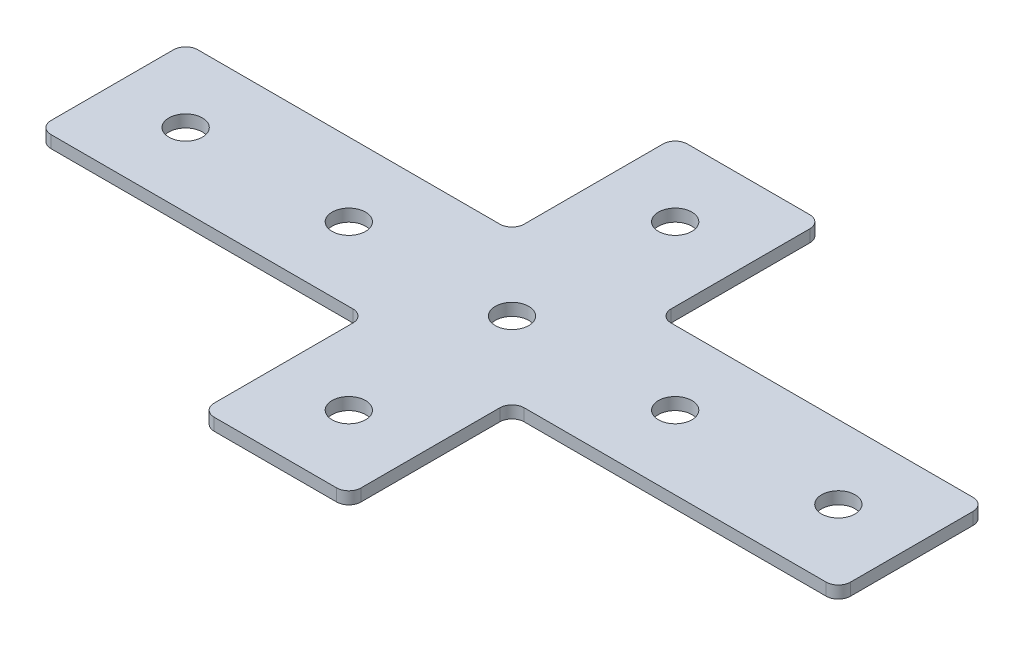
ISO-10303-21;
HEADER;
FILE_DESCRIPTION(('STEP AP214'),'2;1');
FILE_NAME('part.step','',(''),(''),'','','');
FILE_SCHEMA(('AUTOMOTIVE_DESIGN { 1 0 10303 214 1 1 1 1 }'));
ENDSEC;
DATA;
#1=APPLICATION_CONTEXT('core data for automotive mechanical design processes');
#2=APPLICATION_PROTOCOL_DEFINITION('international standard','automotive_design',2000,#1);
#3=PRODUCT_CONTEXT('',#1,'mechanical');
#4=PRODUCT('Part','Part','',(#3));
#5=PRODUCT_RELATED_PRODUCT_CATEGORY('part','',(#4));
#6=PRODUCT_DEFINITION_FORMATION('','',#4);
#7=PRODUCT_DEFINITION_CONTEXT('part definition',#1,'design');
#8=PRODUCT_DEFINITION('design','',#6,#7);
#9=PRODUCT_DEFINITION_SHAPE('','',#8);
#10=(LENGTH_UNIT() NAMED_UNIT(*) SI_UNIT(.MILLI.,.METRE.));
#11=(NAMED_UNIT(*) PLANE_ANGLE_UNIT() SI_UNIT($,.RADIAN.));
#12=(NAMED_UNIT(*) SI_UNIT($,.STERADIAN.) SOLID_ANGLE_UNIT());
#13=UNCERTAINTY_MEASURE_WITH_UNIT(LENGTH_MEASURE(1.E-05),#10,'distance_accuracy_value','');
#14=(GEOMETRIC_REPRESENTATION_CONTEXT(3) GLOBAL_UNCERTAINTY_ASSIGNED_CONTEXT((#13)) GLOBAL_UNIT_ASSIGNED_CONTEXT((#10,
#11,#12)) REPRESENTATION_CONTEXT('',''));
#15=CARTESIAN_POINT('',(0.,0.,0.));
#16=DIRECTION('',(0.,0.,1.));
#17=DIRECTION('',(1.,0.,0.));
#18=AXIS2_PLACEMENT_3D('',#15,#16,#17);
#19=CARTESIAN_POINT('',(-2.01632682041009,1.20798729371791,-0.691220385306224));
#20=DIRECTION('',(0.,-1.,0.));
#21=DIRECTION('',(0.,0.,-1.));
#22=AXIS2_PLACEMENT_3D('',#19,#20,#21);
#23=PLANE('',#22);
#24=CARTESIAN_POINT('',(-42.0163268204101,1.20798729371791,-0.691220385306204));
#25=DIRECTION('',(0.,-1.,0.));
#26=DIRECTION('',(0.,0.,1.));
#27=AXIS2_PLACEMENT_3D('',#24,#25,#26);
#28=CIRCLE('',#27,4.1);
#29=CARTESIAN_POINT('',(-42.0163268204101,1.20798729371791,3.4087796146938));
#30=VERTEX_POINT('',#29);
#31=EDGE_CURVE('E188',#30,#30,#28,.T.);
#32=ORIENTED_EDGE('',*,*,#31,.F.);
#33=EDGE_LOOP('',(#32));
#34=FACE_BOUND('',#33,.T.);
#35=CARTESIAN_POINT('',(-82.0163268204101,1.20798729371791,-0.691220385306206));
#36=DIRECTION('',(0.,-1.,0.));
#37=DIRECTION('',(0.,0.,1.));
#38=AXIS2_PLACEMENT_3D('',#35,#36,#37);
#39=CIRCLE('',#38,4.1);
#40=CARTESIAN_POINT('',(-82.0163268204101,1.20798729371791,3.4087796146938));
#41=VERTEX_POINT('',#40);
#42=EDGE_CURVE('E289',#41,#41,#39,.T.);
#43=ORIENTED_EDGE('',*,*,#42,.F.);
#44=EDGE_LOOP('',(#43));
#45=FACE_BOUND('',#44,.T.);
#46=CARTESIAN_POINT('',(-2.01632682041009,1.20798729371791,-0.691220385306224));
#47=DIRECTION('',(0.,1.,0.));
#48=DIRECTION('',(0.,0.,1.));
#49=AXIS2_PLACEMENT_3D('',#46,#47,#48);
#50=CIRCLE('',#49,4.1);
#51=CARTESIAN_POINT('',(-2.01632682041009,1.20798729371791,3.40877961469378));
#52=VERTEX_POINT('',#51);
#53=EDGE_CURVE('E360',#52,#52,#50,.T.);
#54=ORIENTED_EDGE('',*,*,#53,.T.);
#55=EDGE_LOOP('',(#54));
#56=FACE_BOUND('',#55,.T.);
#57=CARTESIAN_POINT('',(92.9836731795899,1.20798729371791,-15.6912203853062));
#58=DIRECTION('',(0.,1.,0.));
#59=DIRECTION('',(0.,0.,1.));
#60=AXIS2_PLACEMENT_3D('',#57,#58,#59);
#61=CIRCLE('',#60,3.);
#62=CARTESIAN_POINT('',(95.9836731795899,1.20798729371791,-15.6912203853062));
#63=VERTEX_POINT('',#62);
#64=CARTESIAN_POINT('',(92.9836731795899,1.20798729371791,-18.6912203853062));
#65=VERTEX_POINT('',#64);
#66=EDGE_CURVE('E265',#63,#65,#61,.T.);
#67=ORIENTED_EDGE('',*,*,#66,.F.);
#68=DIRECTION('',(0.,0.,-1.));
#69=VECTOR('',#68,1.);
#70=CARTESIAN_POINT('',(95.9836731795899,1.20798729371791,17.3087796146938));
#71=LINE('',#70,#69);
#72=CARTESIAN_POINT('',(95.9836731795899,1.20798729371791,14.3087796146938));
#73=VERTEX_POINT('',#72);
#74=EDGE_CURVE('E366',#73,#63,#71,.T.);
#75=ORIENTED_EDGE('',*,*,#74,.F.);
#76=CARTESIAN_POINT('',(92.9836731795899,1.20798729371791,14.3087796146938));
#77=DIRECTION('',(0.,-1.,0.));
#78=DIRECTION('',(0.,0.,-1.));
#79=AXIS2_PLACEMENT_3D('',#76,#77,#78);
#80=CIRCLE('',#79,3.);
#81=CARTESIAN_POINT('',(92.9836731795899,1.20798729371791,17.3087796146938));
#82=VERTEX_POINT('',#81);
#83=EDGE_CURVE('E391',#73,#82,#80,.T.);
#84=ORIENTED_EDGE('',*,*,#83,.T.);
#85=DIRECTION('',(1.,0.,0.));
#86=VECTOR('',#85,1.);
#87=CARTESIAN_POINT('',(15.9836731795899,1.20798729371791,17.3087796146938));
#88=LINE('',#87,#86);
#89=CARTESIAN_POINT('',(18.9836731795899,1.20798729371791,17.3087796146938));
#90=VERTEX_POINT('',#89);
#91=EDGE_CURVE('E373',#90,#82,#88,.T.);
#92=ORIENTED_EDGE('',*,*,#91,.F.);
#93=CARTESIAN_POINT('',(18.9836731795899,1.20798729371791,20.3087796146938));
#94=DIRECTION('',(0.,-1.,0.));
#95=DIRECTION('',(0.,0.,-1.));
#96=AXIS2_PLACEMENT_3D('',#93,#94,#95);
#97=CIRCLE('',#96,3.);
#98=CARTESIAN_POINT('',(15.9836731795899,1.20798729371791,20.3087796146938));
#99=VERTEX_POINT('',#98);
#100=EDGE_CURVE('E10',#90,#99,#97,.F.);
#101=ORIENTED_EDGE('',*,*,#100,.T.);
#102=DIRECTION('',(0.,0.,-1.));
#103=VECTOR('',#102,1.);
#104=CARTESIAN_POINT('',(15.9836731795899,1.20798729371791,57.3087796146938));
#105=LINE('',#104,#103);
#106=CARTESIAN_POINT('',(15.9836731795899,1.20798729371791,54.3087796146938));
#107=VERTEX_POINT('',#106);
#108=EDGE_CURVE('E371',#107,#99,#105,.T.);
#109=ORIENTED_EDGE('',*,*,#108,.F.);
#110=CARTESIAN_POINT('',(12.9836731795899,1.20798729371791,54.3087796146938));
#111=DIRECTION('',(0.,-1.,0.));
#112=DIRECTION('',(0.,0.,-1.));
#113=AXIS2_PLACEMENT_3D('',#110,#111,#112);
#114=CIRCLE('',#113,3.);
#115=CARTESIAN_POINT('',(12.9836731795899,1.20798729371791,57.3087796146938));
#116=VERTEX_POINT('',#115);
#117=EDGE_CURVE('E393',#107,#116,#114,.T.);
#118=ORIENTED_EDGE('',*,*,#117,.T.);
#119=DIRECTION('',(1.,0.,0.));
#120=VECTOR('',#119,1.);
#121=CARTESIAN_POINT('',(-20.0163268204101,1.20798729371791,57.3087796146938));
#122=LINE('',#121,#120);
#123=CARTESIAN_POINT('',(-17.01632682041,1.20798729371791,57.3087796146938));
#124=VERTEX_POINT('',#123);
#125=EDGE_CURVE('E368',#124,#116,#122,.T.);
#126=ORIENTED_EDGE('',*,*,#125,.F.);
#127=CARTESIAN_POINT('',(-17.01632682041,1.20798729371791,54.3087796146938));
#128=DIRECTION('',(0.,1.,0.));
#129=DIRECTION('',(0.,0.,-1.));
#130=AXIS2_PLACEMENT_3D('',#127,#128,#129);
#131=CIRCLE('',#130,3.);
#132=CARTESIAN_POINT('',(-20.01632682041,1.20798729371791,54.3087796146938));
#133=VERTEX_POINT('',#132);
#134=EDGE_CURVE('E322',#133,#124,#131,.T.);
#135=ORIENTED_EDGE('',*,*,#134,.F.);
#136=DIRECTION('',(0.,0.,-1.));
#137=VECTOR('',#136,1.);
#138=CARTESIAN_POINT('',(-20.01632682041,1.20798729371791,57.3087796146938));
#139=LINE('',#138,#137);
#140=CARTESIAN_POINT('',(-20.01632682041,1.20798729371791,20.3087796146938));
#141=VERTEX_POINT('',#140);
#142=EDGE_CURVE('E301',#133,#141,#139,.T.);
#143=ORIENTED_EDGE('',*,*,#142,.T.);
#144=CARTESIAN_POINT('',(-23.01632682041,1.20798729371791,20.3087796146938));
#145=DIRECTION('',(0.,1.,0.));
#146=DIRECTION('',(0.,0.,-1.));
#147=AXIS2_PLACEMENT_3D('',#144,#145,#146);
#148=CIRCLE('',#147,3.);
#149=CARTESIAN_POINT('',(-23.01632682041,1.20798729371791,17.3087796146938));
#150=VERTEX_POINT('',#149);
#151=EDGE_CURVE('E338',#150,#141,#148,.F.);
#152=ORIENTED_EDGE('',*,*,#151,.F.);
#153=DIRECTION('',(-1.,0.,0.));
#154=VECTOR('',#153,1.);
#155=CARTESIAN_POINT('',(-20.01632682041,1.20798729371791,17.3087796146938));
#156=LINE('',#155,#154);
#157=CARTESIAN_POINT('',(-97.0163268204101,1.20798729371791,17.3087796146938));
#158=VERTEX_POINT('',#157);
#159=EDGE_CURVE('E305',#150,#158,#156,.T.);
#160=ORIENTED_EDGE('',*,*,#159,.T.);
#161=CARTESIAN_POINT('',(-97.0163268204101,1.20798729371791,14.3087796146938));
#162=DIRECTION('',(0.,1.,0.));
#163=DIRECTION('',(0.,0.,-1.));
#164=AXIS2_PLACEMENT_3D('',#161,#162,#163);
#165=CIRCLE('',#164,3.);
#166=CARTESIAN_POINT('',(-100.01632682041,1.20798729371791,14.3087796146938));
#167=VERTEX_POINT('',#166);
#168=EDGE_CURVE('E319',#167,#158,#165,.T.);
#169=ORIENTED_EDGE('',*,*,#168,.F.);
#170=DIRECTION('',(0.,0.,-1.));
#171=VECTOR('',#170,1.);
#172=CARTESIAN_POINT('',(-100.01632682041,1.20798729371791,17.3087796146938));
#173=LINE('',#172,#171);
#174=CARTESIAN_POINT('',(-100.01632682041,1.20798729371791,-15.6912203853062));
#175=VERTEX_POINT('',#174);
#176=EDGE_CURVE('E299',#167,#175,#173,.T.);
#177=ORIENTED_EDGE('',*,*,#176,.T.);
#178=CARTESIAN_POINT('',(-97.0163268204101,1.20798729371791,-15.6912203853062));
#179=DIRECTION('',(0.,-1.,0.));
#180=DIRECTION('',(0.,0.,1.));
#181=AXIS2_PLACEMENT_3D('',#178,#179,#180);
#182=CIRCLE('',#181,3.);
#183=CARTESIAN_POINT('',(-97.0163268204101,1.20798729371791,-18.6912203853062));
#184=VERTEX_POINT('',#183);
#185=EDGE_CURVE('E196',#175,#184,#182,.T.);
#186=ORIENTED_EDGE('',*,*,#185,.T.);
#187=DIRECTION('',(-1.,0.,0.));
#188=VECTOR('',#187,1.);
#189=CARTESIAN_POINT('',(-20.01632682041,1.20798729371791,-18.6912203853062));
#190=LINE('',#189,#188);
#191=CARTESIAN_POINT('',(-23.01632682041,1.20798729371791,-18.6912203853062));
#192=VERTEX_POINT('',#191);
#193=EDGE_CURVE('E206',#192,#184,#190,.T.);
#194=ORIENTED_EDGE('',*,*,#193,.F.);
#195=CARTESIAN_POINT('',(-23.01632682041,1.20798729371791,-21.6912203853062));
#196=DIRECTION('',(0.,-1.,0.));
#197=DIRECTION('',(0.,0.,1.));
#198=AXIS2_PLACEMENT_3D('',#195,#196,#197);
#199=CIRCLE('',#198,3.);
#200=CARTESIAN_POINT('',(-20.01632682041,1.20798729371791,-21.6912203853062));
#201=VERTEX_POINT('',#200);
#202=EDGE_CURVE('E230',#192,#201,#199,.F.);
#203=ORIENTED_EDGE('',*,*,#202,.T.);
#204=DIRECTION('',(0.,0.,1.));
#205=VECTOR('',#204,1.);
#206=CARTESIAN_POINT('',(-20.01632682041,1.20798729371791,-58.6912203853062));
#207=LINE('',#206,#205);
#208=CARTESIAN_POINT('',(-20.01632682041,1.20798729371791,-55.6912203853062));
#209=VERTEX_POINT('',#208);
#210=EDGE_CURVE('E212',#209,#201,#207,.T.);
#211=ORIENTED_EDGE('',*,*,#210,.F.);
#212=CARTESIAN_POINT('',(-17.01632682041,1.20798729371791,-55.6912203853062));
#213=DIRECTION('',(0.,-1.,0.));
#214=DIRECTION('',(0.,0.,1.));
#215=AXIS2_PLACEMENT_3D('',#212,#213,#214);
#216=CIRCLE('',#215,3.);
#217=CARTESIAN_POINT('',(-17.01632682041,1.20798729371791,-58.6912203853062));
#218=VERTEX_POINT('',#217);
#219=EDGE_CURVE('E219',#209,#218,#216,.T.);
#220=ORIENTED_EDGE('',*,*,#219,.T.);
#221=DIRECTION('',(1.,0.,0.));
#222=VECTOR('',#221,1.);
#223=CARTESIAN_POINT('',(-20.0163268204101,1.20798729371791,-58.6912203853062));
#224=LINE('',#223,#222);
#225=CARTESIAN_POINT('',(12.9836731795899,1.20798729371791,-58.6912203853062));
#226=VERTEX_POINT('',#225);
#227=EDGE_CURVE('E240',#218,#226,#224,.T.);
#228=ORIENTED_EDGE('',*,*,#227,.T.);
#229=CARTESIAN_POINT('',(12.9836731795899,1.20798729371791,-55.6912203853062));
#230=DIRECTION('',(0.,1.,0.));
#231=DIRECTION('',(0.,0.,1.));
#232=AXIS2_PLACEMENT_3D('',#229,#230,#231);
#233=CIRCLE('',#232,3.);
#234=CARTESIAN_POINT('',(15.9836731795899,1.20798729371791,-55.6912203853062));
#235=VERTEX_POINT('',#234);
#236=EDGE_CURVE('E268',#235,#226,#233,.T.);
#237=ORIENTED_EDGE('',*,*,#236,.F.);
#238=DIRECTION('',(0.,0.,1.));
#239=VECTOR('',#238,1.);
#240=CARTESIAN_POINT('',(15.9836731795899,1.20798729371791,-58.6912203853062));
#241=LINE('',#240,#239);
#242=CARTESIAN_POINT('',(15.9836731795899,1.20798729371791,-21.6912203853062));
#243=VERTEX_POINT('',#242);
#244=EDGE_CURVE('E243',#235,#243,#241,.T.);
#245=ORIENTED_EDGE('',*,*,#244,.T.);
#246=CARTESIAN_POINT('',(18.9836731795899,1.20798729371791,-21.6912203853062));
#247=DIRECTION('',(0.,1.,0.));
#248=DIRECTION('',(0.,0.,1.));
#249=AXIS2_PLACEMENT_3D('',#246,#247,#248);
#250=CIRCLE('',#249,3.);
#251=CARTESIAN_POINT('',(18.9836731795899,1.20798729371791,-18.6912203853062));
#252=VERTEX_POINT('',#251);
#253=EDGE_CURVE('E285',#252,#243,#250,.F.);
#254=ORIENTED_EDGE('',*,*,#253,.F.);
#255=DIRECTION('',(1.,0.,0.));
#256=VECTOR('',#255,1.);
#257=CARTESIAN_POINT('',(15.9836731795899,1.20798729371791,-18.6912203853062));
#258=LINE('',#257,#256);
#259=EDGE_CURVE('E247',#252,#65,#258,.T.);
#260=ORIENTED_EDGE('',*,*,#259,.T.);
#261=EDGE_LOOP('',(#67,#75,#84,#92,#101,#109,#118,#126,#135,#143,#152,#160,#169,#177,#186,#194,
#203,#211,#220,#228,#237,#245,#254,#260));
#262=FACE_BOUND('',#261,.T.);
#263=CARTESIAN_POINT('',(77.9836731795899,1.20798729371791,-0.691220385306224));
#264=DIRECTION('',(0.,1.,0.));
#265=DIRECTION('',(0.,0.,1.));
#266=AXIS2_PLACEMENT_3D('',#263,#264,#265);
#267=CIRCLE('',#266,4.1);
#268=CARTESIAN_POINT('',(77.9836731795899,1.20798729371791,3.40877961469378));
#269=VERTEX_POINT('',#268);
#270=EDGE_CURVE('E342',#269,#269,#267,.T.);
#271=ORIENTED_EDGE('',*,*,#270,.T.);
#272=EDGE_LOOP('',(#271));
#273=FACE_BOUND('',#272,.T.);
#274=CARTESIAN_POINT('',(-2.0163268204101,1.20798729371791,39.3087796146938));
#275=DIRECTION('',(0.,1.,0.));
#276=DIRECTION('',(0.,0.,1.));
#277=AXIS2_PLACEMENT_3D('',#274,#275,#276);
#278=CIRCLE('',#277,4.1);
#279=CARTESIAN_POINT('',(-2.0163268204101,1.20798729371791,43.4087796146938));
#280=VERTEX_POINT('',#279);
#281=EDGE_CURVE('E348',#280,#280,#278,.T.);
#282=ORIENTED_EDGE('',*,*,#281,.T.);
#283=EDGE_LOOP('',(#282));
#284=FACE_BOUND('',#283,.T.);
#285=CARTESIAN_POINT('',(37.9836731795899,1.20798729371791,-0.691220385306213));
#286=DIRECTION('',(0.,1.,0.));
#287=DIRECTION('',(0.,0.,1.));
#288=AXIS2_PLACEMENT_3D('',#285,#286,#287);
#289=CIRCLE('',#288,4.1);
#290=CARTESIAN_POINT('',(37.9836731795899,1.20798729371791,3.40877961469379));
#291=VERTEX_POINT('',#290);
#292=EDGE_CURVE('E354',#291,#291,#289,.T.);
#293=ORIENTED_EDGE('',*,*,#292,.T.);
#294=EDGE_LOOP('',(#293));
#295=FACE_BOUND('',#294,.T.);
#296=CARTESIAN_POINT('',(-2.0163268204101,1.20798729371791,-40.6912203853062));
#297=DIRECTION('',(0.,-1.,0.));
#298=DIRECTION('',(0.,0.,-1.));
#299=AXIS2_PLACEMENT_3D('',#296,#297,#298);
#300=CIRCLE('',#299,4.1);
#301=CARTESIAN_POINT('',(-2.0163268204101,1.20798729371791,-44.7912203853062));
#302=VERTEX_POINT('',#301);
#303=EDGE_CURVE('E234',#302,#302,#300,.T.);
#304=ORIENTED_EDGE('',*,*,#303,.F.);
#305=EDGE_LOOP('',(#304));
#306=FACE_BOUND('',#305,.T.);
#307=ADVANCED_FACE('F16',(#34,#45,#56,#262,#273,#284,#295,#306),#23,.T.);
#308=CARTESIAN_POINT('',(95.9836731795899,1.20798729371791,17.3087796146938));
#309=DIRECTION('',(1.,0.,0.));
#310=DIRECTION('',(0.,0.,-1.));
#311=AXIS2_PLACEMENT_3D('',#308,#309,#310);
#312=PLANE('',#311);
#313=ORIENTED_EDGE('',*,*,#74,.T.);
#314=DIRECTION('',(0.,1.,0.));
#315=VECTOR('',#314,1.);
#316=CARTESIAN_POINT('',(95.9836731795899,1.20798729371791,-15.6912203853062));
#317=LINE('',#316,#315);
#318=CARTESIAN_POINT('',(95.9836731795899,4.20798729371791,-15.6912203853062));
#319=VERTEX_POINT('',#318);
#320=EDGE_CURVE('E279',#319,#63,#317,.F.);
#321=ORIENTED_EDGE('',*,*,#320,.F.);
#322=DIRECTION('',(0.,0.,-1.));
#323=VECTOR('',#322,1.);
#324=CARTESIAN_POINT('',(95.9836731795899,4.20798729371791,17.3087796146938));
#325=LINE('',#324,#323);
#326=CARTESIAN_POINT('',(95.9836731795899,4.20798729371791,14.3087796146938));
#327=VERTEX_POINT('',#326);
#328=EDGE_CURVE('E363',#327,#319,#325,.T.);
#329=ORIENTED_EDGE('',*,*,#328,.F.);
#330=DIRECTION('',(0.,1.,0.));
#331=VECTOR('',#330,1.);
#332=CARTESIAN_POINT('',(95.9836731795899,1.20798729371791,14.3087796146938));
#333=LINE('',#332,#331);
#334=EDGE_CURVE('E405',#327,#73,#333,.F.);
#335=ORIENTED_EDGE('',*,*,#334,.T.);
#336=EDGE_LOOP('',(#313,#321,#329,#335));
#337=FACE_BOUND('',#336,.T.);
#338=ADVANCED_FACE('F494',(#337),#312,.T.);
#339=CARTESIAN_POINT('',(-2.01632682041009,4.20798729371791,-0.691220385306224));
#340=DIRECTION('',(0.,-1.,0.));
#341=DIRECTION('',(0.,0.,-1.));
#342=AXIS2_PLACEMENT_3D('',#339,#340,#341);
#343=PLANE('',#342);
#344=CARTESIAN_POINT('',(-42.0163268204101,4.20798729371791,-0.691220385306204));
#345=DIRECTION('',(0.,-1.,0.));
#346=DIRECTION('',(0.,0.,1.));
#347=AXIS2_PLACEMENT_3D('',#344,#345,#346);
#348=CIRCLE('',#347,4.1);
#349=CARTESIAN_POINT('',(-42.0163268204101,4.20798729371791,3.4087796146938));
#350=VERTEX_POINT('',#349);
#351=EDGE_CURVE('E292',#350,#350,#348,.T.);
#352=ORIENTED_EDGE('',*,*,#351,.T.);
#353=EDGE_LOOP('',(#352));
#354=FACE_BOUND('',#353,.T.);
#355=CARTESIAN_POINT('',(-82.0163268204101,4.20798729371791,-0.691220385306206));
#356=DIRECTION('',(0.,-1.,0.));
#357=DIRECTION('',(0.,0.,1.));
#358=AXIS2_PLACEMENT_3D('',#355,#356,#357);
#359=CIRCLE('',#358,4.1);
#360=CARTESIAN_POINT('',(-82.0163268204101,4.20798729371791,3.4087796146938));
#361=VERTEX_POINT('',#360);
#362=EDGE_CURVE('E288',#361,#361,#359,.T.);
#363=ORIENTED_EDGE('',*,*,#362,.T.);
#364=EDGE_LOOP('',(#363));
#365=FACE_BOUND('',#364,.T.);
#366=CARTESIAN_POINT('',(-2.01632682041009,4.20798729371791,-0.691220385306224));
#367=DIRECTION('',(0.,1.,0.));
#368=DIRECTION('',(0.,0.,1.));
#369=AXIS2_PLACEMENT_3D('',#366,#367,#368);
#370=CIRCLE('',#369,4.1);
#371=CARTESIAN_POINT('',(-2.01632682041009,4.20798729371791,3.40877961469378));
#372=VERTEX_POINT('',#371);
#373=EDGE_CURVE('E357',#372,#372,#370,.T.);
#374=ORIENTED_EDGE('',*,*,#373,.F.);
#375=EDGE_LOOP('',(#374));
#376=FACE_BOUND('',#375,.T.);
#377=ORIENTED_EDGE('',*,*,#328,.T.);
#378=CARTESIAN_POINT('',(92.9836731795899,4.20798729371791,-15.6912203853062));
#379=DIRECTION('',(0.,1.,0.));
#380=DIRECTION('',(0.,0.,1.));
#381=AXIS2_PLACEMENT_3D('',#378,#379,#380);
#382=CIRCLE('',#381,3.);
#383=CARTESIAN_POINT('',(92.9836731795899,4.20798729371791,-18.6912203853062));
#384=VERTEX_POINT('',#383);
#385=EDGE_CURVE('E250',#384,#319,#382,.F.);
#386=ORIENTED_EDGE('',*,*,#385,.F.);
#387=DIRECTION('',(1.,0.,0.));
#388=VECTOR('',#387,1.);
#389=CARTESIAN_POINT('',(15.9836731795899,4.20798729371791,-18.6912203853062));
#390=LINE('',#389,#388);
#391=CARTESIAN_POINT('',(18.9836731795899,4.20798729371791,-18.6912203853062));
#392=VERTEX_POINT('',#391);
#393=EDGE_CURVE('E244',#392,#384,#390,.T.);
#394=ORIENTED_EDGE('',*,*,#393,.F.);
#395=CARTESIAN_POINT('',(18.9836731795899,4.20798729371791,-21.6912203853062));
#396=DIRECTION('',(0.,1.,0.));
#397=DIRECTION('',(0.,0.,1.));
#398=AXIS2_PLACEMENT_3D('',#395,#396,#397);
#399=CIRCLE('',#398,3.);
#400=CARTESIAN_POINT('',(15.9836731795899,4.20798729371791,-21.6912203853062));
#401=VERTEX_POINT('',#400);
#402=EDGE_CURVE('E282',#401,#392,#399,.T.);
#403=ORIENTED_EDGE('',*,*,#402,.F.);
#404=DIRECTION('',(0.,0.,1.));
#405=VECTOR('',#404,1.);
#406=CARTESIAN_POINT('',(15.9836731795899,4.20798729371791,-58.6912203853062));
#407=LINE('',#406,#405);
#408=CARTESIAN_POINT('',(15.9836731795899,4.20798729371791,-55.6912203853062));
#409=VERTEX_POINT('',#408);
#410=EDGE_CURVE('E253',#409,#401,#407,.T.);
#411=ORIENTED_EDGE('',*,*,#410,.F.);
#412=CARTESIAN_POINT('',(12.9836731795899,4.20798729371791,-55.6912203853062));
#413=DIRECTION('',(0.,1.,0.));
#414=DIRECTION('',(0.,0.,1.));
#415=AXIS2_PLACEMENT_3D('',#412,#413,#414);
#416=CIRCLE('',#415,3.);
#417=CARTESIAN_POINT('',(12.9836731795899,4.20798729371791,-58.6912203853062));
#418=VERTEX_POINT('',#417);
#419=EDGE_CURVE('E260',#418,#409,#416,.F.);
#420=ORIENTED_EDGE('',*,*,#419,.F.);
#421=DIRECTION('',(1.,0.,0.));
#422=VECTOR('',#421,1.);
#423=CARTESIAN_POINT('',(-20.0163268204101,4.20798729371791,-58.6912203853062));
#424=LINE('',#423,#422);
#425=CARTESIAN_POINT('',(-17.01632682041,4.20798729371791,-58.6912203853062));
#426=VERTEX_POINT('',#425);
#427=EDGE_CURVE('E237',#426,#418,#424,.T.);
#428=ORIENTED_EDGE('',*,*,#427,.F.);
#429=CARTESIAN_POINT('',(-17.01632682041,4.20798729371791,-55.6912203853062));
#430=DIRECTION('',(0.,-1.,0.));
#431=DIRECTION('',(0.,0.,1.));
#432=AXIS2_PLACEMENT_3D('',#429,#430,#431);
#433=CIRCLE('',#432,3.);
#434=CARTESIAN_POINT('',(-20.01632682041,4.20798729371791,-55.6912203853062));
#435=VERTEX_POINT('',#434);
#436=EDGE_CURVE('E205',#426,#435,#433,.F.);
#437=ORIENTED_EDGE('',*,*,#436,.T.);
#438=DIRECTION('',(0.,0.,1.));
#439=VECTOR('',#438,1.);
#440=CARTESIAN_POINT('',(-20.01632682041,4.20798729371791,-58.6912203853062));
#441=LINE('',#440,#439);
#442=CARTESIAN_POINT('',(-20.01632682041,4.20798729371791,-21.6912203853062));
#443=VERTEX_POINT('',#442);
#444=EDGE_CURVE('E460',#435,#443,#441,.T.);
#445=ORIENTED_EDGE('',*,*,#444,.T.);
#446=CARTESIAN_POINT('',(-23.01632682041,4.20798729371791,-21.6912203853062));
#447=DIRECTION('',(0.,-1.,0.));
#448=DIRECTION('',(0.,0.,1.));
#449=AXIS2_PLACEMENT_3D('',#446,#447,#448);
#450=CIRCLE('',#449,3.);
#451=CARTESIAN_POINT('',(-23.01632682041,4.20798729371791,-18.6912203853062));
#452=VERTEX_POINT('',#451);
#453=EDGE_CURVE('E197',#443,#452,#450,.T.);
#454=ORIENTED_EDGE('',*,*,#453,.T.);
#455=DIRECTION('',(-1.,0.,0.));
#456=VECTOR('',#455,1.);
#457=CARTESIAN_POINT('',(-20.01632682041,4.20798729371791,-18.6912203853062));
#458=LINE('',#457,#456);
#459=CARTESIAN_POINT('',(-97.0163268204101,4.20798729371791,-18.6912203853062));
#460=VERTEX_POINT('',#459);
#461=EDGE_CURVE('E204',#452,#460,#458,.T.);
#462=ORIENTED_EDGE('',*,*,#461,.T.);
#463=CARTESIAN_POINT('',(-97.0163268204101,4.20798729371791,-15.6912203853062));
#464=DIRECTION('',(0.,-1.,0.));
#465=DIRECTION('',(0.,0.,1.));
#466=AXIS2_PLACEMENT_3D('',#463,#464,#465);
#467=CIRCLE('',#466,3.);
#468=CARTESIAN_POINT('',(-100.01632682041,4.20798729371791,-15.6912203853062));
#469=VERTEX_POINT('',#468);
#470=EDGE_CURVE('E193',#460,#469,#467,.F.);
#471=ORIENTED_EDGE('',*,*,#470,.T.);
#472=DIRECTION('',(0.,0.,-1.));
#473=VECTOR('',#472,1.);
#474=CARTESIAN_POINT('',(-100.01632682041,4.20798729371791,17.3087796146938));
#475=LINE('',#474,#473);
#476=CARTESIAN_POINT('',(-100.01632682041,4.20798729371791,14.3087796146938));
#477=VERTEX_POINT('',#476);
#478=EDGE_CURVE('E178',#477,#469,#475,.T.);
#479=ORIENTED_EDGE('',*,*,#478,.F.);
#480=CARTESIAN_POINT('',(-97.0163268204101,4.20798729371791,14.3087796146938));
#481=DIRECTION('',(0.,1.,0.));
#482=DIRECTION('',(0.,0.,-1.));
#483=AXIS2_PLACEMENT_3D('',#480,#481,#482);
#484=CIRCLE('',#483,3.);
#485=CARTESIAN_POINT('',(-97.0163268204101,4.20798729371791,17.3087796146938));
#486=VERTEX_POINT('',#485);
#487=EDGE_CURVE('E307',#486,#477,#484,.F.);
#488=ORIENTED_EDGE('',*,*,#487,.F.);
#489=DIRECTION('',(-1.,0.,0.));
#490=VECTOR('',#489,1.);
#491=CARTESIAN_POINT('',(-20.01632682041,4.20798729371791,17.3087796146938));
#492=LINE('',#491,#490);
#493=CARTESIAN_POINT('',(-23.01632682041,4.20798729371791,17.3087796146938));
#494=VERTEX_POINT('',#493);
#495=EDGE_CURVE('E302',#494,#486,#492,.T.);
#496=ORIENTED_EDGE('',*,*,#495,.F.);
#497=CARTESIAN_POINT('',(-23.01632682041,4.20798729371791,20.3087796146938));
#498=DIRECTION('',(0.,1.,0.));
#499=DIRECTION('',(0.,0.,-1.));
#500=AXIS2_PLACEMENT_3D('',#497,#498,#499);
#501=CIRCLE('',#500,3.);
#502=CARTESIAN_POINT('',(-20.01632682041,4.20798729371791,20.3087796146938));
#503=VERTEX_POINT('',#502);
#504=EDGE_CURVE('E336',#503,#494,#501,.T.);
#505=ORIENTED_EDGE('',*,*,#504,.F.);
#506=DIRECTION('',(0.,0.,-1.));
#507=VECTOR('',#506,1.);
#508=CARTESIAN_POINT('',(-20.01632682041,4.20798729371791,57.3087796146938));
#509=LINE('',#508,#507);
#510=CARTESIAN_POINT('',(-20.01632682041,4.20798729371791,54.3087796146938));
#511=VERTEX_POINT('',#510);
#512=EDGE_CURVE('E187',#511,#503,#509,.T.);
#513=ORIENTED_EDGE('',*,*,#512,.F.);
#514=CARTESIAN_POINT('',(-17.01632682041,4.20798729371791,54.3087796146938));
#515=DIRECTION('',(0.,1.,0.));
#516=DIRECTION('',(0.,0.,-1.));
#517=AXIS2_PLACEMENT_3D('',#514,#515,#516);
#518=CIRCLE('',#517,3.);
#519=CARTESIAN_POINT('',(-17.01632682041,4.20798729371791,57.3087796146938));
#520=VERTEX_POINT('',#519);
#521=EDGE_CURVE('E314',#520,#511,#518,.F.);
#522=ORIENTED_EDGE('',*,*,#521,.F.);
#523=DIRECTION('',(1.,0.,0.));
#524=VECTOR('',#523,1.);
#525=CARTESIAN_POINT('',(-20.0163268204101,4.20798729371791,57.3087796146938));
#526=LINE('',#525,#524);
#527=CARTESIAN_POINT('',(12.9836731795899,4.20798729371791,57.3087796146938));
#528=VERTEX_POINT('',#527);
#529=EDGE_CURVE('E378',#520,#528,#526,.T.);
#530=ORIENTED_EDGE('',*,*,#529,.T.);
#531=CARTESIAN_POINT('',(12.9836731795899,4.20798729371791,54.3087796146938));
#532=DIRECTION('',(0.,-1.,0.));
#533=DIRECTION('',(0.,0.,-1.));
#534=AXIS2_PLACEMENT_3D('',#531,#532,#533);
#535=CIRCLE('',#534,3.);
#536=CARTESIAN_POINT('',(15.9836731795899,4.20798729371791,54.3087796146938));
#537=VERTEX_POINT('',#536);
#538=EDGE_CURVE('E386',#528,#537,#535,.F.);
#539=ORIENTED_EDGE('',*,*,#538,.T.);
#540=DIRECTION('',(0.,0.,-1.));
#541=VECTOR('',#540,1.);
#542=CARTESIAN_POINT('',(15.9836731795899,4.20798729371791,57.3087796146938));
#543=LINE('',#542,#541);
#544=CARTESIAN_POINT('',(15.9836731795899,4.20798729371791,20.3087796146938));
#545=VERTEX_POINT('',#544);
#546=EDGE_CURVE('E380',#537,#545,#543,.T.);
#547=ORIENTED_EDGE('',*,*,#546,.T.);
#548=CARTESIAN_POINT('',(18.9836731795899,4.20798729371791,20.3087796146938));
#549=DIRECTION('',(0.,-1.,0.));
#550=DIRECTION('',(0.,0.,-1.));
#551=AXIS2_PLACEMENT_3D('',#548,#549,#550);
#552=CIRCLE('',#551,3.);
#553=CARTESIAN_POINT('',(18.9836731795899,4.20798729371791,17.3087796146938));
#554=VERTEX_POINT('',#553);
#555=EDGE_CURVE('E24',#545,#554,#552,.T.);
#556=ORIENTED_EDGE('',*,*,#555,.T.);
#557=DIRECTION('',(1.,0.,0.));
#558=VECTOR('',#557,1.);
#559=CARTESIAN_POINT('',(15.9836731795899,4.20798729371791,17.3087796146938));
#560=LINE('',#559,#558);
#561=CARTESIAN_POINT('',(92.9836731795899,4.20798729371791,17.3087796146938));
#562=VERTEX_POINT('',#561);
#563=EDGE_CURVE('E369',#554,#562,#560,.T.);
#564=ORIENTED_EDGE('',*,*,#563,.T.);
#565=CARTESIAN_POINT('',(92.9836731795899,4.20798729371791,14.3087796146938));
#566=DIRECTION('',(0.,-1.,0.));
#567=DIRECTION('',(0.,0.,-1.));
#568=AXIS2_PLACEMENT_3D('',#565,#566,#567);
#569=CIRCLE('',#568,3.);
#570=EDGE_CURVE('E376',#562,#327,#569,.F.);
#571=ORIENTED_EDGE('',*,*,#570,.T.);
#572=EDGE_LOOP('',(#377,#386,#394,#403,#411,#420,#428,#437,#445,#454,#462,#471,#479,#488,#496,
#505,#513,#522,#530,#539,#547,#556,#564,#571));
#573=FACE_BOUND('',#572,.T.);
#574=CARTESIAN_POINT('',(77.9836731795899,4.20798729371791,-0.691220385306224));
#575=DIRECTION('',(0.,1.,0.));
#576=DIRECTION('',(0.,0.,1.));
#577=AXIS2_PLACEMENT_3D('',#574,#575,#576);
#578=CIRCLE('',#577,4.1);
#579=CARTESIAN_POINT('',(77.9836731795899,4.20798729371791,3.40877961469378));
#580=VERTEX_POINT('',#579);
#581=EDGE_CURVE('E341',#580,#580,#578,.T.);
#582=ORIENTED_EDGE('',*,*,#581,.F.);
#583=EDGE_LOOP('',(#582));
#584=FACE_BOUND('',#583,.T.);
#585=CARTESIAN_POINT('',(-2.0163268204101,4.20798729371791,39.3087796146938));
#586=DIRECTION('',(0.,1.,0.));
#587=DIRECTION('',(0.,0.,1.));
#588=AXIS2_PLACEMENT_3D('',#585,#586,#587);
#589=CIRCLE('',#588,4.1);
#590=CARTESIAN_POINT('',(-2.0163268204101,4.20798729371791,43.4087796146938));
#591=VERTEX_POINT('',#590);
#592=EDGE_CURVE('E345',#591,#591,#589,.T.);
#593=ORIENTED_EDGE('',*,*,#592,.F.);
#594=EDGE_LOOP('',(#593));
#595=FACE_BOUND('',#594,.T.);
#596=CARTESIAN_POINT('',(37.9836731795899,4.20798729371791,-0.691220385306213));
#597=DIRECTION('',(0.,1.,0.));
#598=DIRECTION('',(0.,0.,1.));
#599=AXIS2_PLACEMENT_3D('',#596,#597,#598);
#600=CIRCLE('',#599,4.1);
#601=CARTESIAN_POINT('',(37.9836731795899,4.20798729371791,3.40877961469379));
#602=VERTEX_POINT('',#601);
#603=EDGE_CURVE('E351',#602,#602,#600,.T.);
#604=ORIENTED_EDGE('',*,*,#603,.F.);
#605=EDGE_LOOP('',(#604));
#606=FACE_BOUND('',#605,.T.);
#607=CARTESIAN_POINT('',(-2.0163268204101,4.20798729371791,-40.6912203853062));
#608=DIRECTION('',(0.,-1.,0.));
#609=DIRECTION('',(0.,0.,-1.));
#610=AXIS2_PLACEMENT_3D('',#607,#608,#609);
#611=CIRCLE('',#610,4.1);
#612=CARTESIAN_POINT('',(-2.0163268204101,4.20798729371791,-44.7912203853062));
#613=VERTEX_POINT('',#612);
#614=EDGE_CURVE('E233',#613,#613,#611,.T.);
#615=ORIENTED_EDGE('',*,*,#614,.T.);
#616=EDGE_LOOP('',(#615));
#617=FACE_BOUND('',#616,.T.);
#618=ADVANCED_FACE('F200',(#354,#365,#376,#573,#584,#595,#606,#617),#343,.F.);
#619=CARTESIAN_POINT('',(-2.01632682041009,1.20798729371791,-0.691220385306224));
#620=DIRECTION('',(0.,1.,0.));
#621=DIRECTION('',(0.,0.,1.));
#622=AXIS2_PLACEMENT_3D('',#619,#620,#621);
#623=CYLINDRICAL_SURFACE('',#622,4.1);
#624=ORIENTED_EDGE('',*,*,#53,.F.);
#625=EDGE_LOOP('',(#624));
#626=FACE_BOUND('',#625,.T.);
#627=ORIENTED_EDGE('',*,*,#373,.T.);
#628=EDGE_LOOP('',(#627));
#629=FACE_BOUND('',#628,.T.);
#630=ADVANCED_FACE('F502',(#626,#629),#623,.F.);
#631=CARTESIAN_POINT('',(37.9836731795899,1.20798729371791,-0.691220385306213));
#632=DIRECTION('',(0.,1.,0.));
#633=DIRECTION('',(0.,0.,1.));
#634=AXIS2_PLACEMENT_3D('',#631,#632,#633);
#635=CYLINDRICAL_SURFACE('',#634,4.1);
#636=ORIENTED_EDGE('',*,*,#603,.T.);
#637=EDGE_LOOP('',(#636));
#638=FACE_BOUND('',#637,.T.);
#639=ORIENTED_EDGE('',*,*,#292,.F.);
#640=EDGE_LOOP('',(#639));
#641=FACE_BOUND('',#640,.T.);
#642=ADVANCED_FACE('F530',(#638,#641),#635,.F.);
#643=CARTESIAN_POINT('',(77.9836731795899,1.20798729371791,-0.691220385306224));
#644=DIRECTION('',(0.,1.,0.));
#645=DIRECTION('',(0.,0.,1.));
#646=AXIS2_PLACEMENT_3D('',#643,#644,#645);
#647=CYLINDRICAL_SURFACE('',#646,4.1);
#648=ORIENTED_EDGE('',*,*,#581,.T.);
#649=EDGE_LOOP('',(#648));
#650=FACE_BOUND('',#649,.T.);
#651=ORIENTED_EDGE('',*,*,#270,.F.);
#652=EDGE_LOOP('',(#651));
#653=FACE_BOUND('',#652,.T.);
#654=ADVANCED_FACE('F528',(#650,#653),#647,.F.);
#655=CARTESIAN_POINT('',(-100.01632682041,1.20798729371791,17.3087796146938));
#656=DIRECTION('',(-1.,0.,0.));
#657=DIRECTION('',(0.,0.,-1.));
#658=AXIS2_PLACEMENT_3D('',#655,#656,#657);
#659=PLANE('',#658);
#660=ORIENTED_EDGE('',*,*,#478,.T.);
#661=DIRECTION('',(0.,1.,0.));
#662=VECTOR('',#661,1.);
#663=CARTESIAN_POINT('',(-100.01632682041,1.20798729371791,-15.6912203853062));
#664=LINE('',#663,#662);
#665=EDGE_CURVE('E182',#469,#175,#664,.F.);
#666=ORIENTED_EDGE('',*,*,#665,.T.);
#667=ORIENTED_EDGE('',*,*,#176,.F.);
#668=DIRECTION('',(0.,1.,0.));
#669=VECTOR('',#668,1.);
#670=CARTESIAN_POINT('',(-100.01632682041,1.20798729371791,14.3087796146938));
#671=LINE('',#670,#669);
#672=EDGE_CURVE('E184',#477,#167,#671,.F.);
#673=ORIENTED_EDGE('',*,*,#672,.F.);
#674=EDGE_LOOP('',(#660,#666,#667,#673));
#675=FACE_BOUND('',#674,.T.);
#676=ADVANCED_FACE('F180',(#675),#659,.T.);
#677=CARTESIAN_POINT('',(-42.0163268204101,1.20798729371791,-0.691220385306204));
#678=DIRECTION('',(0.,1.,0.));
#679=DIRECTION('',(0.,0.,1.));
#680=AXIS2_PLACEMENT_3D('',#677,#678,#679);
#681=CYLINDRICAL_SURFACE('',#680,4.1);
#682=ORIENTED_EDGE('',*,*,#31,.T.);
#683=EDGE_LOOP('',(#682));
#684=FACE_BOUND('',#683,.T.);
#685=ORIENTED_EDGE('',*,*,#351,.F.);
#686=EDGE_LOOP('',(#685));
#687=FACE_BOUND('',#686,.T.);
#688=ADVANCED_FACE('F710',(#684,#687),#681,.F.);
#689=CARTESIAN_POINT('',(-82.0163268204101,1.20798729371791,-0.691220385306206));
#690=DIRECTION('',(0.,1.,0.));
#691=DIRECTION('',(0.,0.,1.));
#692=AXIS2_PLACEMENT_3D('',#689,#690,#691);
#693=CYLINDRICAL_SURFACE('',#692,4.1);
#694=ORIENTED_EDGE('',*,*,#362,.F.);
#695=EDGE_LOOP('',(#694));
#696=FACE_BOUND('',#695,.T.);
#697=ORIENTED_EDGE('',*,*,#42,.T.);
#698=EDGE_LOOP('',(#697));
#699=FACE_BOUND('',#698,.T.);
#700=ADVANCED_FACE('F538',(#696,#699),#693,.F.);
#701=CARTESIAN_POINT('',(15.9836731795899,1.20798729371791,17.3087796146938));
#702=DIRECTION('',(0.,0.,1.));
#703=DIRECTION('',(1.,0.,0.));
#704=AXIS2_PLACEMENT_3D('',#701,#702,#703);
#705=PLANE('',#704);
#706=ORIENTED_EDGE('',*,*,#563,.F.);
#707=DIRECTION('',(0.,1.,0.));
#708=VECTOR('',#707,1.);
#709=CARTESIAN_POINT('',(18.9836731795899,1.20798729371791,17.3087796146938));
#710=LINE('',#709,#708);
#711=EDGE_CURVE('E403',#554,#90,#710,.F.);
#712=ORIENTED_EDGE('',*,*,#711,.T.);
#713=ORIENTED_EDGE('',*,*,#91,.T.);
#714=DIRECTION('',(0.,1.,0.));
#715=VECTOR('',#714,1.);
#716=CARTESIAN_POINT('',(92.9836731795899,1.20798729371791,17.3087796146938));
#717=LINE('',#716,#715);
#718=EDGE_CURVE('E400',#82,#562,#717,.T.);
#719=ORIENTED_EDGE('',*,*,#718,.T.);
#720=EDGE_LOOP('',(#706,#712,#713,#719));
#721=FACE_BOUND('',#720,.T.);
#722=ADVANCED_FACE('F411',(#721),#705,.T.);
#723=CARTESIAN_POINT('',(15.9836731795899,1.20798729371791,57.3087796146938));
#724=DIRECTION('',(1.,0.,0.));
#725=DIRECTION('',(0.,0.,-1.));
#726=AXIS2_PLACEMENT_3D('',#723,#724,#725);
#727=PLANE('',#726);
#728=ORIENTED_EDGE('',*,*,#546,.F.);
#729=DIRECTION('',(0.,1.,0.));
#730=VECTOR('',#729,1.);
#731=CARTESIAN_POINT('',(15.9836731795899,1.20798729371791,54.3087796146938));
#732=LINE('',#731,#730);
#733=EDGE_CURVE('E36',#537,#107,#732,.F.);
#734=ORIENTED_EDGE('',*,*,#733,.T.);
#735=ORIENTED_EDGE('',*,*,#108,.T.);
#736=DIRECTION('',(0.,1.,0.));
#737=VECTOR('',#736,1.);
#738=CARTESIAN_POINT('',(15.9836731795899,4.20798729371791,20.3087796146938));
#739=LINE('',#738,#737);
#740=EDGE_CURVE('E396',#99,#545,#739,.T.);
#741=ORIENTED_EDGE('',*,*,#740,.T.);
#742=EDGE_LOOP('',(#728,#734,#735,#741));
#743=FACE_BOUND('',#742,.T.);
#744=ADVANCED_FACE('F414',(#743),#727,.T.);
#745=CARTESIAN_POINT('',(-20.0163268204101,1.20798729371791,57.3087796146938));
#746=DIRECTION('',(0.,0.,1.));
#747=DIRECTION('',(1.,0.,0.));
#748=AXIS2_PLACEMENT_3D('',#745,#746,#747);
#749=PLANE('',#748);
#750=ORIENTED_EDGE('',*,*,#529,.F.);
#751=DIRECTION('',(0.,1.,0.));
#752=VECTOR('',#751,1.);
#753=CARTESIAN_POINT('',(-17.01632682041,1.20798729371791,57.3087796146938));
#754=LINE('',#753,#752);
#755=EDGE_CURVE('E316',#124,#520,#754,.T.);
#756=ORIENTED_EDGE('',*,*,#755,.F.);
#757=ORIENTED_EDGE('',*,*,#125,.T.);
#758=DIRECTION('',(0.,1.,0.));
#759=VECTOR('',#758,1.);
#760=CARTESIAN_POINT('',(12.9836731795899,1.20798729371791,57.3087796146938));
#761=LINE('',#760,#759);
#762=EDGE_CURVE('E388',#116,#528,#761,.T.);
#763=ORIENTED_EDGE('',*,*,#762,.T.);
#764=EDGE_LOOP('',(#750,#756,#757,#763));
#765=FACE_BOUND('',#764,.T.);
#766=ADVANCED_FACE('F423',(#765),#749,.T.);
#767=CARTESIAN_POINT('',(12.9836731795899,1.20798729371791,54.3087796146938));
#768=DIRECTION('',(0.,1.,0.));
#769=DIRECTION('',(0.,0.,1.));
#770=AXIS2_PLACEMENT_3D('',#767,#768,#769);
#771=CYLINDRICAL_SURFACE('',#770,3.);
#772=ORIENTED_EDGE('',*,*,#117,.F.);
#773=ORIENTED_EDGE('',*,*,#733,.F.);
#774=ORIENTED_EDGE('',*,*,#538,.F.);
#775=ORIENTED_EDGE('',*,*,#762,.F.);
#776=EDGE_LOOP('',(#772,#773,#774,#775));
#777=FACE_BOUND('',#776,.T.);
#778=ADVANCED_FACE('F420',(#777),#771,.T.);
#779=CARTESIAN_POINT('',(18.9836731795899,1.20798729371791,20.3087796146938));
#780=DIRECTION('',(0.,-1.,0.));
#781=DIRECTION('',(0.,0.,-1.));
#782=AXIS2_PLACEMENT_3D('',#779,#780,#781);
#783=CYLINDRICAL_SURFACE('',#782,3.);
#784=ORIENTED_EDGE('',*,*,#100,.F.);
#785=ORIENTED_EDGE('',*,*,#711,.F.);
#786=ORIENTED_EDGE('',*,*,#555,.F.);
#787=ORIENTED_EDGE('',*,*,#740,.F.);
#788=EDGE_LOOP('',(#784,#785,#786,#787));
#789=FACE_BOUND('',#788,.T.);
#790=ADVANCED_FACE('F413',(#789),#783,.F.);
#791=CARTESIAN_POINT('',(92.9836731795899,1.20798729371791,14.3087796146938));
#792=DIRECTION('',(0.,1.,0.));
#793=DIRECTION('',(0.,0.,1.));
#794=AXIS2_PLACEMENT_3D('',#791,#792,#793);
#795=CYLINDRICAL_SURFACE('',#794,3.);
#796=ORIENTED_EDGE('',*,*,#83,.F.);
#797=ORIENTED_EDGE('',*,*,#334,.F.);
#798=ORIENTED_EDGE('',*,*,#570,.F.);
#799=ORIENTED_EDGE('',*,*,#718,.F.);
#800=EDGE_LOOP('',(#796,#797,#798,#799));
#801=FACE_BOUND('',#800,.T.);
#802=ADVANCED_FACE('F18',(#801),#795,.T.);
#803=CARTESIAN_POINT('',(-2.0163268204101,1.20798729371791,39.3087796146938));
#804=DIRECTION('',(0.,1.,0.));
#805=DIRECTION('',(0.,0.,1.));
#806=AXIS2_PLACEMENT_3D('',#803,#804,#805);
#807=CYLINDRICAL_SURFACE('',#806,4.1);
#808=ORIENTED_EDGE('',*,*,#592,.T.);
#809=EDGE_LOOP('',(#808));
#810=FACE_BOUND('',#809,.T.);
#811=ORIENTED_EDGE('',*,*,#281,.F.);
#812=EDGE_LOOP('',(#811));
#813=FACE_BOUND('',#812,.T.);
#814=ADVANCED_FACE('F515',(#810,#813),#807,.F.);
#815=CARTESIAN_POINT('',(-20.01632682041,1.20798729371791,17.3087796146938));
#816=DIRECTION('',(0.,0.,1.));
#817=DIRECTION('',(-1.,0.,0.));
#818=AXIS2_PLACEMENT_3D('',#815,#816,#817);
#819=PLANE('',#818);
#820=ORIENTED_EDGE('',*,*,#495,.T.);
#821=DIRECTION('',(0.,1.,0.));
#822=VECTOR('',#821,1.);
#823=CARTESIAN_POINT('',(-97.0163268204101,1.20798729371791,17.3087796146938));
#824=LINE('',#823,#822);
#825=EDGE_CURVE('E330',#158,#486,#824,.T.);
#826=ORIENTED_EDGE('',*,*,#825,.F.);
#827=ORIENTED_EDGE('',*,*,#159,.F.);
#828=DIRECTION('',(0.,1.,0.));
#829=VECTOR('',#828,1.);
#830=CARTESIAN_POINT('',(-23.01632682041,1.20798729371791,17.3087796146938));
#831=LINE('',#830,#829);
#832=EDGE_CURVE('E333',#494,#150,#831,.F.);
#833=ORIENTED_EDGE('',*,*,#832,.F.);
#834=EDGE_LOOP('',(#820,#826,#827,#833));
#835=FACE_BOUND('',#834,.T.);
#836=ADVANCED_FACE('F441',(#835),#819,.T.);
#837=CARTESIAN_POINT('',(-20.01632682041,1.20798729371791,57.3087796146938));
#838=DIRECTION('',(-1.,0.,0.));
#839=DIRECTION('',(0.,0.,-1.));
#840=AXIS2_PLACEMENT_3D('',#837,#838,#839);
#841=PLANE('',#840);
#842=ORIENTED_EDGE('',*,*,#512,.T.);
#843=DIRECTION('',(0.,1.,0.));
#844=VECTOR('',#843,1.);
#845=CARTESIAN_POINT('',(-20.01632682041,4.20798729371791,20.3087796146938));
#846=LINE('',#845,#844);
#847=EDGE_CURVE('E325',#141,#503,#846,.T.);
#848=ORIENTED_EDGE('',*,*,#847,.F.);
#849=ORIENTED_EDGE('',*,*,#142,.F.);
#850=DIRECTION('',(0.,1.,0.));
#851=VECTOR('',#850,1.);
#852=CARTESIAN_POINT('',(-20.01632682041,1.20798729371791,54.3087796146938));
#853=LINE('',#852,#851);
#854=EDGE_CURVE('E328',#511,#133,#853,.F.);
#855=ORIENTED_EDGE('',*,*,#854,.F.);
#856=EDGE_LOOP('',(#842,#848,#849,#855));
#857=FACE_BOUND('',#856,.T.);
#858=ADVANCED_FACE('F434',(#857),#841,.T.);
#859=CARTESIAN_POINT('',(-17.01632682041,1.20798729371791,54.3087796146938));
#860=DIRECTION('',(0.,1.,0.));
#861=DIRECTION('',(0.,0.,1.));
#862=AXIS2_PLACEMENT_3D('',#859,#860,#861);
#863=CYLINDRICAL_SURFACE('',#862,3.);
#864=ORIENTED_EDGE('',*,*,#134,.T.);
#865=ORIENTED_EDGE('',*,*,#755,.T.);
#866=ORIENTED_EDGE('',*,*,#521,.T.);
#867=ORIENTED_EDGE('',*,*,#854,.T.);
#868=EDGE_LOOP('',(#864,#865,#866,#867));
#869=FACE_BOUND('',#868,.T.);
#870=ADVANCED_FACE('F430',(#869),#863,.T.);
#871=CARTESIAN_POINT('',(-23.01632682041,1.20798729371791,20.3087796146938));
#872=DIRECTION('',(0.,-1.,0.));
#873=DIRECTION('',(0.,0.,-1.));
#874=AXIS2_PLACEMENT_3D('',#871,#872,#873);
#875=CYLINDRICAL_SURFACE('',#874,3.);
#876=ORIENTED_EDGE('',*,*,#151,.T.);
#877=ORIENTED_EDGE('',*,*,#847,.T.);
#878=ORIENTED_EDGE('',*,*,#504,.T.);
#879=ORIENTED_EDGE('',*,*,#832,.T.);
#880=EDGE_LOOP('',(#876,#877,#878,#879));
#881=FACE_BOUND('',#880,.T.);
#882=ADVANCED_FACE('F436',(#881),#875,.F.);
#883=CARTESIAN_POINT('',(-97.0163268204101,1.20798729371791,14.3087796146938));
#884=DIRECTION('',(0.,1.,0.));
#885=DIRECTION('',(0.,0.,1.));
#886=AXIS2_PLACEMENT_3D('',#883,#884,#885);
#887=CYLINDRICAL_SURFACE('',#886,3.);
#888=ORIENTED_EDGE('',*,*,#168,.T.);
#889=ORIENTED_EDGE('',*,*,#825,.T.);
#890=ORIENTED_EDGE('',*,*,#487,.T.);
#891=ORIENTED_EDGE('',*,*,#672,.T.);
#892=EDGE_LOOP('',(#888,#889,#890,#891));
#893=FACE_BOUND('',#892,.T.);
#894=ADVANCED_FACE('F444',(#893),#887,.T.);
#895=CARTESIAN_POINT('',(15.9836731795899,1.20798729371791,-18.6912203853062));
#896=DIRECTION('',(0.,0.,-1.));
#897=DIRECTION('',(1.,0.,0.));
#898=AXIS2_PLACEMENT_3D('',#895,#896,#897);
#899=PLANE('',#898);
#900=ORIENTED_EDGE('',*,*,#393,.T.);
#901=DIRECTION('',(0.,1.,0.));
#902=VECTOR('',#901,1.);
#903=CARTESIAN_POINT('',(92.9836731795899,1.20798729371791,-18.6912203853062));
#904=LINE('',#903,#902);
#905=EDGE_CURVE('E275',#65,#384,#904,.T.);
#906=ORIENTED_EDGE('',*,*,#905,.F.);
#907=ORIENTED_EDGE('',*,*,#259,.F.);
#908=DIRECTION('',(0.,1.,0.));
#909=VECTOR('',#908,1.);
#910=CARTESIAN_POINT('',(18.9836731795899,1.20798729371791,-18.6912203853062));
#911=LINE('',#910,#909);
#912=EDGE_CURVE('E277',#392,#252,#911,.F.);
#913=ORIENTED_EDGE('',*,*,#912,.F.);
#914=EDGE_LOOP('',(#900,#906,#907,#913));
#915=FACE_BOUND('',#914,.T.);
#916=ADVANCED_FACE('F483',(#915),#899,.T.);
#917=CARTESIAN_POINT('',(15.9836731795899,1.20798729371791,-58.6912203853062));
#918=DIRECTION('',(1.,0.,0.));
#919=DIRECTION('',(0.,0.,1.));
#920=AXIS2_PLACEMENT_3D('',#917,#918,#919);
#921=PLANE('',#920);
#922=ORIENTED_EDGE('',*,*,#410,.T.);
#923=DIRECTION('',(0.,1.,0.));
#924=VECTOR('',#923,1.);
#925=CARTESIAN_POINT('',(15.9836731795899,4.20798729371791,-21.6912203853062));
#926=LINE('',#925,#924);
#927=EDGE_CURVE('E271',#243,#401,#926,.T.);
#928=ORIENTED_EDGE('',*,*,#927,.F.);
#929=ORIENTED_EDGE('',*,*,#244,.F.);
#930=DIRECTION('',(0.,1.,0.));
#931=VECTOR('',#930,1.);
#932=CARTESIAN_POINT('',(15.9836731795899,1.20798729371791,-55.6912203853062));
#933=LINE('',#932,#931);
#934=EDGE_CURVE('E273',#409,#235,#933,.F.);
#935=ORIENTED_EDGE('',*,*,#934,.F.);
#936=EDGE_LOOP('',(#922,#928,#929,#935));
#937=FACE_BOUND('',#936,.T.);
#938=ADVANCED_FACE('F475',(#937),#921,.T.);
#939=CARTESIAN_POINT('',(-20.0163268204101,1.20798729371791,-58.6912203853062));
#940=DIRECTION('',(0.,0.,-1.));
#941=DIRECTION('',(1.,0.,0.));
#942=AXIS2_PLACEMENT_3D('',#939,#940,#941);
#943=PLANE('',#942);
#944=ORIENTED_EDGE('',*,*,#427,.T.);
#945=DIRECTION('',(0.,1.,0.));
#946=VECTOR('',#945,1.);
#947=CARTESIAN_POINT('',(12.9836731795899,1.20798729371791,-58.6912203853062));
#948=LINE('',#947,#946);
#949=EDGE_CURVE('E263',#226,#418,#948,.T.);
#950=ORIENTED_EDGE('',*,*,#949,.F.);
#951=ORIENTED_EDGE('',*,*,#227,.F.);
#952=DIRECTION('',(0.,1.,0.));
#953=VECTOR('',#952,1.);
#954=CARTESIAN_POINT('',(-17.01632682041,1.20798729371791,-58.6912203853062));
#955=LINE('',#954,#953);
#956=EDGE_CURVE('E209',#218,#426,#955,.T.);
#957=ORIENTED_EDGE('',*,*,#956,.T.);
#958=EDGE_LOOP('',(#944,#950,#951,#957));
#959=FACE_BOUND('',#958,.T.);
#960=ADVANCED_FACE('F469',(#959),#943,.T.);
#961=CARTESIAN_POINT('',(12.9836731795899,1.20798729371791,-55.6912203853062));
#962=DIRECTION('',(0.,1.,0.));
#963=DIRECTION('',(0.,0.,-1.));
#964=AXIS2_PLACEMENT_3D('',#961,#962,#963);
#965=CYLINDRICAL_SURFACE('',#964,3.);
#966=ORIENTED_EDGE('',*,*,#236,.T.);
#967=ORIENTED_EDGE('',*,*,#949,.T.);
#968=ORIENTED_EDGE('',*,*,#419,.T.);
#969=ORIENTED_EDGE('',*,*,#934,.T.);
#970=EDGE_LOOP('',(#966,#967,#968,#969));
#971=FACE_BOUND('',#970,.T.);
#972=ADVANCED_FACE('F471',(#971),#965,.T.);
#973=CARTESIAN_POINT('',(18.9836731795899,1.20798729371791,-21.6912203853062));
#974=DIRECTION('',(0.,-1.,0.));
#975=DIRECTION('',(0.,0.,1.));
#976=AXIS2_PLACEMENT_3D('',#973,#974,#975);
#977=CYLINDRICAL_SURFACE('',#976,3.);
#978=ORIENTED_EDGE('',*,*,#253,.T.);
#979=ORIENTED_EDGE('',*,*,#927,.T.);
#980=ORIENTED_EDGE('',*,*,#402,.T.);
#981=ORIENTED_EDGE('',*,*,#912,.T.);
#982=EDGE_LOOP('',(#978,#979,#980,#981));
#983=FACE_BOUND('',#982,.T.);
#984=ADVANCED_FACE('F479',(#983),#977,.F.);
#985=CARTESIAN_POINT('',(92.9836731795899,1.20798729371791,-15.6912203853062));
#986=DIRECTION('',(0.,1.,0.));
#987=DIRECTION('',(0.,0.,-1.));
#988=AXIS2_PLACEMENT_3D('',#985,#986,#987);
#989=CYLINDRICAL_SURFACE('',#988,3.);
#990=ORIENTED_EDGE('',*,*,#66,.T.);
#991=ORIENTED_EDGE('',*,*,#905,.T.);
#992=ORIENTED_EDGE('',*,*,#385,.T.);
#993=ORIENTED_EDGE('',*,*,#320,.T.);
#994=EDGE_LOOP('',(#990,#991,#992,#993));
#995=FACE_BOUND('',#994,.T.);
#996=ADVANCED_FACE('F486',(#995),#989,.T.);
#997=CARTESIAN_POINT('',(-2.0163268204101,1.20798729371791,-40.6912203853062));
#998=DIRECTION('',(0.,1.,0.));
#999=DIRECTION('',(0.,0.,-1.));
#1000=AXIS2_PLACEMENT_3D('',#997,#998,#999);
#1001=CYLINDRICAL_SURFACE('',#1000,4.1);
#1002=ORIENTED_EDGE('',*,*,#614,.F.);
#1003=EDGE_LOOP('',(#1002));
#1004=FACE_BOUND('',#1003,.T.);
#1005=ORIENTED_EDGE('',*,*,#303,.T.);
#1006=EDGE_LOOP('',(#1005));
#1007=FACE_BOUND('',#1006,.T.);
#1008=ADVANCED_FACE('F652',(#1004,#1007),#1001,.F.);
#1009=CARTESIAN_POINT('',(-20.01632682041,1.20798729371791,-18.6912203853062));
#1010=DIRECTION('',(0.,0.,-1.));
#1011=DIRECTION('',(-1.,0.,0.));
#1012=AXIS2_PLACEMENT_3D('',#1009,#1010,#1011);
#1013=PLANE('',#1012);
#1014=ORIENTED_EDGE('',*,*,#461,.F.);
#1015=DIRECTION('',(0.,1.,0.));
#1016=VECTOR('',#1015,1.);
#1017=CARTESIAN_POINT('',(-23.01632682041,1.20798729371791,-18.6912203853062));
#1018=LINE('',#1017,#1016);
#1019=EDGE_CURVE('E198',#452,#192,#1018,.F.);
#1020=ORIENTED_EDGE('',*,*,#1019,.T.);
#1021=ORIENTED_EDGE('',*,*,#193,.T.);
#1022=DIRECTION('',(0.,1.,0.));
#1023=VECTOR('',#1022,1.);
#1024=CARTESIAN_POINT('',(-97.0163268204101,1.20798729371791,-18.6912203853062));
#1025=LINE('',#1024,#1023);
#1026=EDGE_CURVE('E226',#184,#460,#1025,.T.);
#1027=ORIENTED_EDGE('',*,*,#1026,.T.);
#1028=EDGE_LOOP('',(#1014,#1020,#1021,#1027));
#1029=FACE_BOUND('',#1028,.T.);
#1030=ADVANCED_FACE('F449',(#1029),#1013,.T.);
#1031=CARTESIAN_POINT('',(-20.01632682041,1.20798729371791,-58.6912203853062));
#1032=DIRECTION('',(-1.,0.,0.));
#1033=DIRECTION('',(0.,0.,1.));
#1034=AXIS2_PLACEMENT_3D('',#1031,#1032,#1033);
#1035=PLANE('',#1034);
#1036=ORIENTED_EDGE('',*,*,#444,.F.);
#1037=DIRECTION('',(0.,1.,0.));
#1038=VECTOR('',#1037,1.);
#1039=CARTESIAN_POINT('',(-20.01632682041,1.20798729371791,-55.6912203853062));
#1040=LINE('',#1039,#1038);
#1041=EDGE_CURVE('E224',#435,#209,#1040,.F.);
#1042=ORIENTED_EDGE('',*,*,#1041,.T.);
#1043=ORIENTED_EDGE('',*,*,#210,.T.);
#1044=DIRECTION('',(0.,1.,0.));
#1045=VECTOR('',#1044,1.);
#1046=CARTESIAN_POINT('',(-20.01632682041,4.20798729371791,-21.6912203853062));
#1047=LINE('',#1046,#1045);
#1048=EDGE_CURVE('E222',#201,#443,#1047,.T.);
#1049=ORIENTED_EDGE('',*,*,#1048,.T.);
#1050=EDGE_LOOP('',(#1036,#1042,#1043,#1049));
#1051=FACE_BOUND('',#1050,.T.);
#1052=ADVANCED_FACE('F457',(#1051),#1035,.T.);
#1053=CARTESIAN_POINT('',(-17.01632682041,1.20798729371791,-55.6912203853062));
#1054=DIRECTION('',(0.,1.,0.));
#1055=DIRECTION('',(0.,0.,-1.));
#1056=AXIS2_PLACEMENT_3D('',#1053,#1054,#1055);
#1057=CYLINDRICAL_SURFACE('',#1056,3.);
#1058=ORIENTED_EDGE('',*,*,#219,.F.);
#1059=ORIENTED_EDGE('',*,*,#1041,.F.);
#1060=ORIENTED_EDGE('',*,*,#436,.F.);
#1061=ORIENTED_EDGE('',*,*,#956,.F.);
#1062=EDGE_LOOP('',(#1058,#1059,#1060,#1061));
#1063=FACE_BOUND('',#1062,.T.);
#1064=ADVANCED_FACE('F465',(#1063),#1057,.T.);
#1065=CARTESIAN_POINT('',(-23.01632682041,1.20798729371791,-21.6912203853062));
#1066=DIRECTION('',(0.,-1.,0.));
#1067=DIRECTION('',(0.,0.,1.));
#1068=AXIS2_PLACEMENT_3D('',#1065,#1066,#1067);
#1069=CYLINDRICAL_SURFACE('',#1068,3.);
#1070=ORIENTED_EDGE('',*,*,#202,.F.);
#1071=ORIENTED_EDGE('',*,*,#1019,.F.);
#1072=ORIENTED_EDGE('',*,*,#453,.F.);
#1073=ORIENTED_EDGE('',*,*,#1048,.F.);
#1074=EDGE_LOOP('',(#1070,#1071,#1072,#1073));
#1075=FACE_BOUND('',#1074,.T.);
#1076=ADVANCED_FACE('F452',(#1075),#1069,.F.);
#1077=CARTESIAN_POINT('',(-97.0163268204101,1.20798729371791,-15.6912203853062));
#1078=DIRECTION('',(0.,1.,0.));
#1079=DIRECTION('',(0.,0.,-1.));
#1080=AXIS2_PLACEMENT_3D('',#1077,#1078,#1079);
#1081=CYLINDRICAL_SURFACE('',#1080,3.);
#1082=ORIENTED_EDGE('',*,*,#185,.F.);
#1083=ORIENTED_EDGE('',*,*,#665,.F.);
#1084=ORIENTED_EDGE('',*,*,#470,.F.);
#1085=ORIENTED_EDGE('',*,*,#1026,.F.);
#1086=EDGE_LOOP('',(#1082,#1083,#1084,#1085));
#1087=FACE_BOUND('',#1086,.T.);
#1088=ADVANCED_FACE('F192',(#1087),#1081,.T.);
#1089=CLOSED_SHELL('',(#307,#338,#618,#630,#642,#654,#676,#688,#700,#722,#744,#766,#778,#790,
#802,#814,#836,#858,#870,#882,#894,#916,#938,#960,#972,#984,#996,#1008,#1030,#1052,#1064,#1076,#1088));
#1090=MANIFOLD_SOLID_BREP('B1',#1089);
#1091=ADVANCED_BREP_SHAPE_REPRESENTATION('',(#18,#1090),#14);
#1092=SHAPE_DEFINITION_REPRESENTATION(#9,#1091);
ENDSEC;
END-ISO-10303-21;
